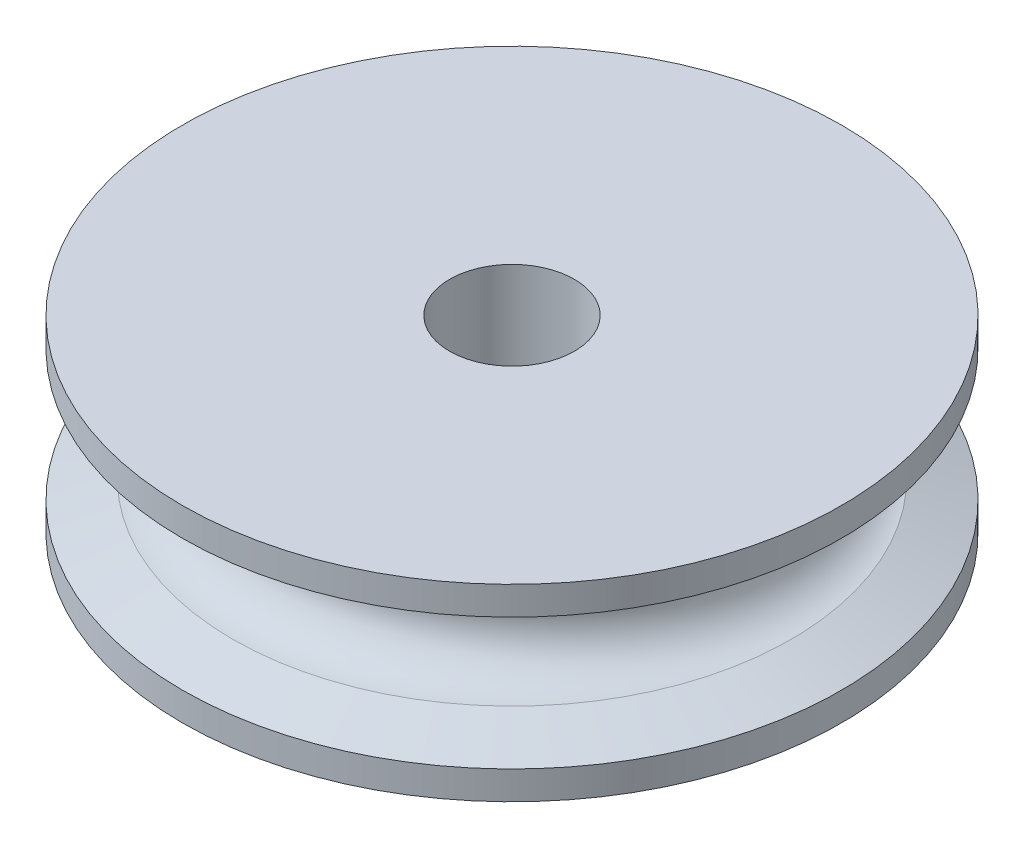
ISO-10303-21;
HEADER;
FILE_DESCRIPTION(('STEP AP214'),'2;1');
FILE_NAME('part.step','',(''),(''),'','','');
FILE_SCHEMA(('AUTOMOTIVE_DESIGN { 1 0 10303 214 1 1 1 1 }'));
ENDSEC;
DATA;
#1=APPLICATION_CONTEXT('core data for automotive mechanical design processes');
#2=APPLICATION_PROTOCOL_DEFINITION('international standard','automotive_design',2000,#1);
#3=PRODUCT_CONTEXT('',#1,'mechanical');
#4=PRODUCT('Part','Part','',(#3));
#5=PRODUCT_RELATED_PRODUCT_CATEGORY('part','',(#4));
#6=PRODUCT_DEFINITION_FORMATION('','',#4);
#7=PRODUCT_DEFINITION_CONTEXT('part definition',#1,'design');
#8=PRODUCT_DEFINITION('design','',#6,#7);
#9=PRODUCT_DEFINITION_SHAPE('','',#8);
#10=(LENGTH_UNIT() NAMED_UNIT(*) SI_UNIT(.MILLI.,.METRE.));
#11=(NAMED_UNIT(*) PLANE_ANGLE_UNIT() SI_UNIT($,.RADIAN.));
#12=(NAMED_UNIT(*) SI_UNIT($,.STERADIAN.) SOLID_ANGLE_UNIT());
#13=UNCERTAINTY_MEASURE_WITH_UNIT(LENGTH_MEASURE(1.E-05),#10,'distance_accuracy_value','');
#14=(GEOMETRIC_REPRESENTATION_CONTEXT(3) GLOBAL_UNCERTAINTY_ASSIGNED_CONTEXT((#13)) GLOBAL_UNIT_ASSIGNED_CONTEXT((#10,
#11,#12)) REPRESENTATION_CONTEXT('',''));
#15=CARTESIAN_POINT('',(0.,0.,0.));
#16=DIRECTION('',(0.,0.,1.));
#17=DIRECTION('',(1.,0.,0.));
#18=AXIS2_PLACEMENT_3D('',#15,#16,#17);
#19=CARTESIAN_POINT('',(0.,6.,0.));
#20=DIRECTION('',(0.,-1.,0.));
#21=DIRECTION('',(0.,0.,-1.));
#22=AXIS2_PLACEMENT_3D('',#19,#20,#21);
#23=CYLINDRICAL_SURFACE('',#22,14.);
#24=CARTESIAN_POINT('',(0.,1.20700820746095,0.));
#25=DIRECTION('',(0.,-1.,0.));
#26=DIRECTION('',(0.,0.,-1.));
#27=AXIS2_PLACEMENT_3D('',#24,#25,#26);
#28=CIRCLE('',#27,14.);
#29=CARTESIAN_POINT('',(0.,1.20700820746095,-14.));
#30=VERTEX_POINT('',#29);
#31=EDGE_CURVE('E10',#30,#30,#28,.T.);
#32=ORIENTED_EDGE('',*,*,#31,.T.);
#33=EDGE_LOOP('',(#32));
#34=FACE_BOUND('',#33,.T.);
#35=CARTESIAN_POINT('',(0.,0.,0.));
#36=DIRECTION('',(0.,1.,0.));
#37=DIRECTION('',(0.,0.,1.));
#38=AXIS2_PLACEMENT_3D('',#35,#36,#37);
#39=CIRCLE('',#38,14.);
#40=CARTESIAN_POINT('',(0.,0.,14.));
#41=VERTEX_POINT('',#40);
#42=EDGE_CURVE('E57',#41,#41,#39,.T.);
#43=ORIENTED_EDGE('',*,*,#42,.T.);
#44=EDGE_LOOP('',(#43));
#45=FACE_BOUND('',#44,.T.);
#46=ADVANCED_FACE('F36',(#34,#45),#23,.T.);
#47=CARTESIAN_POINT('',(0.,0.,0.));
#48=DIRECTION('',(0.,1.,0.));
#49=DIRECTION('',(0.,0.,1.));
#50=AXIS2_PLACEMENT_3D('',#47,#48,#49);
#51=PLANE('',#50);
#52=ORIENTED_EDGE('',*,*,#42,.F.);
#53=EDGE_LOOP('',(#52));
#54=FACE_BOUND('',#53,.T.);
#55=CARTESIAN_POINT('',(0.,0.,0.));
#56=DIRECTION('',(0.,1.,0.));
#57=DIRECTION('',(0.,0.,1.));
#58=AXIS2_PLACEMENT_3D('',#55,#56,#57);
#59=CIRCLE('',#58,2.65);
#60=CARTESIAN_POINT('',(0.,0.,2.65));
#61=VERTEX_POINT('',#60);
#62=EDGE_CURVE('E64',#61,#61,#59,.T.);
#63=ORIENTED_EDGE('',*,*,#62,.T.);
#64=EDGE_LOOP('',(#63));
#65=FACE_BOUND('',#64,.T.);
#66=ADVANCED_FACE('F87',(#54,#65),#51,.F.);
#67=CARTESIAN_POINT('',(0.,6.,0.));
#68=DIRECTION('',(0.,-1.,0.));
#69=DIRECTION('',(0.,0.,-1.));
#70=AXIS2_PLACEMENT_3D('',#67,#68,#69);
#71=CYLINDRICAL_SURFACE('',#70,2.65);
#72=ORIENTED_EDGE('',*,*,#62,.F.);
#73=EDGE_LOOP('',(#72));
#74=FACE_BOUND('',#73,.T.);
#75=CARTESIAN_POINT('',(0.,8.,0.));
#76=DIRECTION('',(0.,1.,0.));
#77=DIRECTION('',(0.,0.,1.));
#78=AXIS2_PLACEMENT_3D('',#75,#76,#77);
#79=CIRCLE('',#78,2.65);
#80=CARTESIAN_POINT('',(0.,8.,2.65));
#81=VERTEX_POINT('',#80);
#82=EDGE_CURVE('E61',#81,#81,#79,.T.);
#83=ORIENTED_EDGE('',*,*,#82,.T.);
#84=EDGE_LOOP('',(#83));
#85=FACE_BOUND('',#84,.T.);
#86=ADVANCED_FACE('F73',(#74,#85),#71,.F.);
#87=CARTESIAN_POINT('',(0.,8.,0.));
#88=DIRECTION('',(0.,1.,0.));
#89=DIRECTION('',(0.,0.,1.));
#90=AXIS2_PLACEMENT_3D('',#87,#88,#89);
#91=PLANE('',#90);
#92=CARTESIAN_POINT('',(0.,8.,0.));
#93=DIRECTION('',(0.,1.,0.));
#94=DIRECTION('',(0.,0.,1.));
#95=AXIS2_PLACEMENT_3D('',#92,#93,#94);
#96=CIRCLE('',#95,14.);
#97=CARTESIAN_POINT('',(0.,8.,14.));
#98=VERTEX_POINT('',#97);
#99=EDGE_CURVE('E67',#98,#98,#96,.T.);
#100=ORIENTED_EDGE('',*,*,#99,.T.);
#101=EDGE_LOOP('',(#100));
#102=FACE_BOUND('',#101,.T.);
#103=ORIENTED_EDGE('',*,*,#82,.F.);
#104=EDGE_LOOP('',(#103));
#105=FACE_BOUND('',#104,.T.);
#106=ADVANCED_FACE('F75',(#102,#105),#91,.T.);
#107=CARTESIAN_POINT('',(0.,8.,0.));
#108=DIRECTION('',(0.,-1.,0.));
#109=DIRECTION('',(0.,0.,-1.));
#110=AXIS2_PLACEMENT_3D('',#107,#108,#109);
#111=CYLINDRICAL_SURFACE('',#110,14.);
#112=CARTESIAN_POINT('',(0.,6.79299179253905,0.));
#113=DIRECTION('',(0.,1.,0.));
#114=DIRECTION('',(0.,0.,1.));
#115=AXIS2_PLACEMENT_3D('',#112,#113,#114);
#116=CIRCLE('',#115,14.);
#117=CARTESIAN_POINT('',(0.,6.79299179253905,14.));
#118=VERTEX_POINT('',#117);
#119=EDGE_CURVE('E52',#118,#118,#116,.T.);
#120=ORIENTED_EDGE('',*,*,#119,.T.);
#121=EDGE_LOOP('',(#120));
#122=FACE_BOUND('',#121,.T.);
#123=ORIENTED_EDGE('',*,*,#99,.F.);
#124=EDGE_LOOP('',(#123));
#125=FACE_BOUND('',#124,.T.);
#126=ADVANCED_FACE('F77',(#122,#125),#111,.T.);
#127=CARTESIAN_POINT('',(0.,4.,0.));
#128=DIRECTION('',(0.,1.,0.));
#129=DIRECTION('',(0.,0.,1.));
#130=AXIS2_PLACEMENT_3D('',#127,#128,#129);
#131=TOROIDAL_SURFACE('',#130,12.,2.);
#132=CARTESIAN_POINT('',(0.,2.00500586246999,0.));
#133=DIRECTION('',(0.,1.,0.));
#134=DIRECTION('',(0.,0.,1.));
#135=AXIS2_PLACEMENT_3D('',#132,#133,#134);
#136=CIRCLE('',#135,11.85858433174);
#137=CARTESIAN_POINT('',(0.,2.00500586246999,11.85858433174));
#138=VERTEX_POINT('',#137);
#139=EDGE_CURVE('E44',#138,#138,#136,.T.);
#140=ORIENTED_EDGE('',*,*,#139,.T.);
#141=EDGE_LOOP('',(#140));
#142=FACE_BOUND('',#141,.T.);
#143=CARTESIAN_POINT('',(0.,4.,0.));
#144=DIRECTION('',(0.,1.,0.));
#145=DIRECTION('',(0.,0.,1.));
#146=AXIS2_PLACEMENT_3D('',#143,#144,#145);
#147=CIRCLE('',#146,10.);
#148=CARTESIAN_POINT('',(0.,4.,10.));
#149=VERTEX_POINT('',#148);
#150=EDGE_CURVE('E58',#149,#149,#147,.T.);
#151=ORIENTED_EDGE('',*,*,#150,.F.);
#152=EDGE_LOOP('',(#151));
#153=FACE_BOUND('',#152,.T.);
#154=ADVANCED_FACE('F84',(#142,#153),#131,.F.);
#155=CARTESIAN_POINT('',(0.,4.,0.));
#156=DIRECTION('',(0.,1.,0.));
#157=DIRECTION('',(0.,0.,1.));
#158=AXIS2_PLACEMENT_3D('',#155,#156,#157);
#159=TOROIDAL_SURFACE('',#158,12.,2.);
#160=CARTESIAN_POINT('',(0.,5.99499413753001,0.));
#161=DIRECTION('',(0.,-1.,0.));
#162=DIRECTION('',(0.,0.,-1.));
#163=AXIS2_PLACEMENT_3D('',#160,#161,#162);
#164=CIRCLE('',#163,11.85858433174);
#165=CARTESIAN_POINT('',(0.,5.99499413753001,-11.85858433174));
#166=VERTEX_POINT('',#165);
#167=EDGE_CURVE('E48',#166,#166,#164,.T.);
#168=ORIENTED_EDGE('',*,*,#167,.T.);
#169=EDGE_LOOP('',(#168));
#170=FACE_BOUND('',#169,.T.);
#171=ORIENTED_EDGE('',*,*,#150,.T.);
#172=EDGE_LOOP('',(#171));
#173=FACE_BOUND('',#172,.T.);
#174=ADVANCED_FACE('F99',(#170,#173),#159,.F.);
#175=CARTESIAN_POINT('',(0.,6.79299179253905,0.));
#176=DIRECTION('',(0.,1.,0.));
#177=DIRECTION('',(0.,0.,1.));
#178=AXIS2_PLACEMENT_3D('',#175,#176,#177);
#179=CONICAL_SURFACE('',#178,14.,1.21408788705844);
#180=ORIENTED_EDGE('',*,*,#167,.F.);
#181=EDGE_LOOP('',(#180));
#182=FACE_BOUND('',#181,.T.);
#183=ORIENTED_EDGE('',*,*,#119,.F.);
#184=EDGE_LOOP('',(#183));
#185=FACE_BOUND('',#184,.T.);
#186=ADVANCED_FACE('F102',(#182,#185),#179,.T.);
#187=CARTESIAN_POINT('',(0.,2.00500586247212,0.));
#188=DIRECTION('',(0.,-1.,0.));
#189=DIRECTION('',(0.,0.,-1.));
#190=AXIS2_PLACEMENT_3D('',#187,#188,#189);
#191=CONICAL_SURFACE('',#190,11.8585843317402,1.21408788705844);
#192=ORIENTED_EDGE('',*,*,#31,.F.);
#193=EDGE_LOOP('',(#192));
#194=FACE_BOUND('',#193,.T.);
#195=ORIENTED_EDGE('',*,*,#139,.F.);
#196=EDGE_LOOP('',(#195));
#197=FACE_BOUND('',#196,.T.);
#198=ADVANCED_FACE('F39',(#194,#197),#191,.T.);
#199=CLOSED_SHELL('',(#46,#66,#86,#106,#126,#154,#174,#186,#198));
#200=MANIFOLD_SOLID_BREP('B2',#199);
#201=ADVANCED_BREP_SHAPE_REPRESENTATION('',(#18,#200),#14);
#202=SHAPE_DEFINITION_REPRESENTATION(#9,#201);
ENDSEC;
END-ISO-10303-21;
